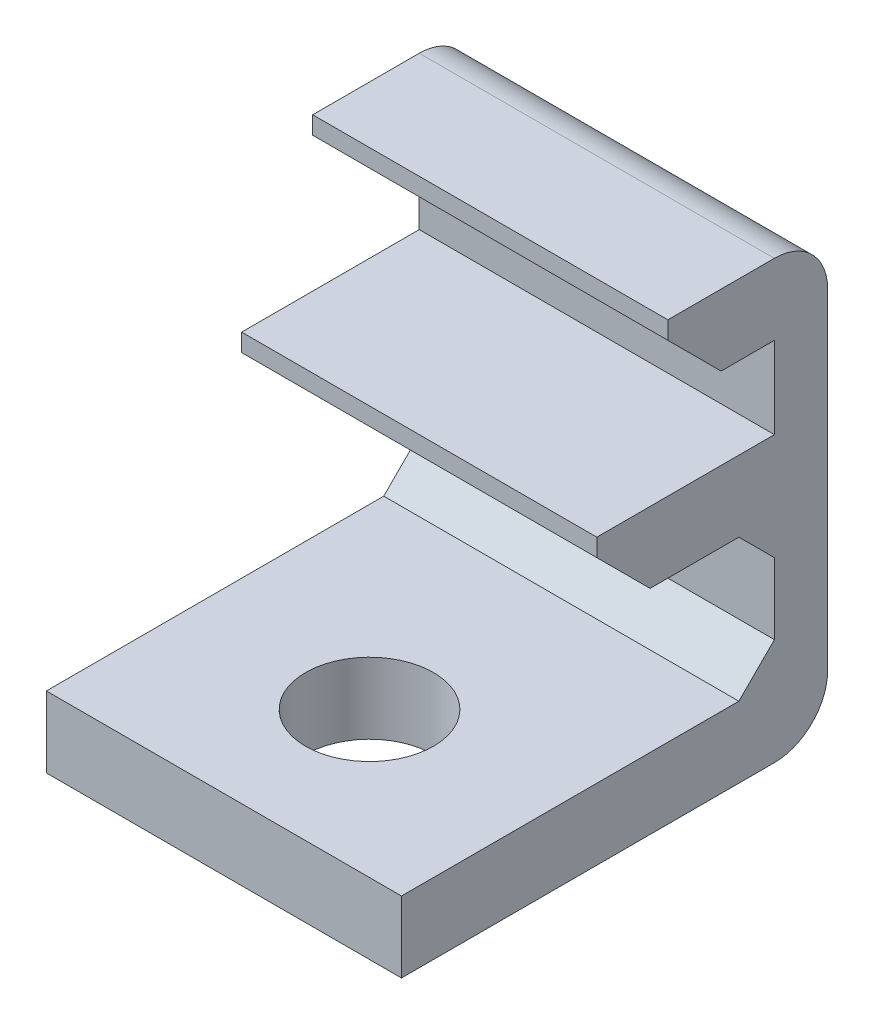
ISO-10303-21;
HEADER;
FILE_DESCRIPTION(('STEP AP214'),'2;1');
FILE_NAME('part.step','',(''),(''),'','','');
FILE_SCHEMA(('AUTOMOTIVE_DESIGN { 1 0 10303 214 1 1 1 1 }'));
ENDSEC;
DATA;
#1=APPLICATION_CONTEXT('core data for automotive mechanical design processes');
#2=APPLICATION_PROTOCOL_DEFINITION('international standard','automotive_design',2000,#1);
#3=PRODUCT_CONTEXT('',#1,'mechanical');
#4=PRODUCT('Part','Part','',(#3));
#5=PRODUCT_RELATED_PRODUCT_CATEGORY('part','',(#4));
#6=PRODUCT_DEFINITION_FORMATION('','',#4);
#7=PRODUCT_DEFINITION_CONTEXT('part definition',#1,'design');
#8=PRODUCT_DEFINITION('design','',#6,#7);
#9=PRODUCT_DEFINITION_SHAPE('','',#8);
#10=(LENGTH_UNIT() NAMED_UNIT(*) SI_UNIT(.MILLI.,.METRE.));
#11=(NAMED_UNIT(*) PLANE_ANGLE_UNIT() SI_UNIT($,.RADIAN.));
#12=(NAMED_UNIT(*) SI_UNIT($,.STERADIAN.) SOLID_ANGLE_UNIT());
#13=UNCERTAINTY_MEASURE_WITH_UNIT(LENGTH_MEASURE(1.E-05),#10,'distance_accuracy_value','');
#14=(GEOMETRIC_REPRESENTATION_CONTEXT(3) GLOBAL_UNCERTAINTY_ASSIGNED_CONTEXT((#13)) GLOBAL_UNIT_ASSIGNED_CONTEXT((#10,
#11,#12)) REPRESENTATION_CONTEXT('',''));
#15=CARTESIAN_POINT('',(0.,0.,0.));
#16=DIRECTION('',(0.,0.,1.));
#17=DIRECTION('',(1.,0.,0.));
#18=AXIS2_PLACEMENT_3D('',#15,#16,#17);
#19=CARTESIAN_POINT('',(5.,0.,-0.249999999999999));
#20=DIRECTION('',(0.,0.,-1.));
#21=DIRECTION('',(0.,1.,0.));
#22=AXIS2_PLACEMENT_3D('',#19,#20,#21);
#23=PLANE('',#22);
#24=DIRECTION('',(0.,-1.,0.));
#25=VECTOR('',#24,1.);
#26=CARTESIAN_POINT('',(-5.,0.,-0.249999999999999));
#27=LINE('',#26,#25);
#28=CARTESIAN_POINT('',(-5.,1.85,-0.249999999999999));
#29=VERTEX_POINT('',#28);
#30=CARTESIAN_POINT('',(-5.,1.35,-0.249999999999999));
#31=VERTEX_POINT('',#30);
#32=EDGE_CURVE('E217',#29,#31,#27,.T.);
#33=ORIENTED_EDGE('',*,*,#32,.T.);
#34=DIRECTION('',(1.,0.,0.));
#35=VECTOR('',#34,1.);
#36=CARTESIAN_POINT('',(5.,1.35,-0.249999999999999));
#37=LINE('',#36,#35);
#38=CARTESIAN_POINT('',(5.,1.35,-0.249999999999999));
#39=VERTEX_POINT('',#38);
#40=EDGE_CURVE('E11',#31,#39,#37,.T.);
#41=ORIENTED_EDGE('',*,*,#40,.T.);
#42=DIRECTION('',(0.,-1.,0.));
#43=VECTOR('',#42,1.);
#44=CARTESIAN_POINT('',(5.,0.,-0.249999999999999));
#45=LINE('',#44,#43);
#46=CARTESIAN_POINT('',(5.,1.85,-0.249999999999999));
#47=VERTEX_POINT('',#46);
#48=EDGE_CURVE('E248',#47,#39,#45,.T.);
#49=ORIENTED_EDGE('',*,*,#48,.F.);
#50=DIRECTION('',(-1.,0.,0.));
#51=VECTOR('',#50,1.);
#52=CARTESIAN_POINT('',(5.,1.85,-0.249999999999999));
#53=LINE('',#52,#51);
#54=EDGE_CURVE('E216',#47,#29,#53,.T.);
#55=ORIENTED_EDGE('',*,*,#54,.T.);
#56=EDGE_LOOP('',(#33,#41,#49,#55));
#57=FACE_BOUND('',#56,.T.);
#58=ADVANCED_FACE('F41',(#57),#23,.F.);
#59=CARTESIAN_POINT('',(5.,-0.149999999999999,0.));
#60=DIRECTION('',(0.,1.,0.));
#61=DIRECTION('',(0.,0.,1.));
#62=AXIS2_PLACEMENT_3D('',#59,#60,#61);
#63=PLANE('',#62);
#64=DIRECTION('',(0.,0.,-1.));
#65=VECTOR('',#64,1.);
#66=CARTESIAN_POINT('',(5.,-0.149999999999999,0.));
#67=LINE('',#66,#65);
#68=CARTESIAN_POINT('',(5.,-0.15,-1.75));
#69=VERTEX_POINT('',#68);
#70=CARTESIAN_POINT('',(5.,-0.150000000000001,-4.25000000000001));
#71=VERTEX_POINT('',#70);
#72=EDGE_CURVE('E196',#69,#71,#67,.T.);
#73=ORIENTED_EDGE('',*,*,#72,.F.);
#74=DIRECTION('',(-1.,0.,0.));
#75=VECTOR('',#74,1.);
#76=CARTESIAN_POINT('',(5.,-0.15,-1.75));
#77=LINE('',#76,#75);
#78=CARTESIAN_POINT('',(-5.,-0.15,-1.75));
#79=VERTEX_POINT('',#78);
#80=EDGE_CURVE('E50',#69,#79,#77,.T.);
#81=ORIENTED_EDGE('',*,*,#80,.T.);
#82=DIRECTION('',(0.,0.,-1.));
#83=VECTOR('',#82,1.);
#84=CARTESIAN_POINT('',(-5.,-0.149999999999999,0.));
#85=LINE('',#84,#83);
#86=CARTESIAN_POINT('',(-5.,-0.150000000000001,-4.25000000000001));
#87=VERTEX_POINT('',#86);
#88=EDGE_CURVE('E219',#79,#87,#85,.T.);
#89=ORIENTED_EDGE('',*,*,#88,.T.);
#90=DIRECTION('',(1.,0.,0.));
#91=VECTOR('',#90,1.);
#92=CARTESIAN_POINT('',(5.,-0.150000000000001,-4.25000000000001));
#93=LINE('',#92,#91);
#94=EDGE_CURVE('E264',#87,#71,#93,.T.);
#95=ORIENTED_EDGE('',*,*,#94,.T.);
#96=EDGE_LOOP('',(#73,#81,#89,#95));
#97=FACE_BOUND('',#96,.T.);
#98=ADVANCED_FACE('F308',(#97),#63,.F.);
#99=CARTESIAN_POINT('',(5.,0.,-5.25));
#100=DIRECTION('',(0.,0.,-1.));
#101=DIRECTION('',(0.,1.,0.));
#102=AXIS2_PLACEMENT_3D('',#99,#100,#101);
#103=PLANE('',#102);
#104=DIRECTION('',(0.,-1.,0.));
#105=VECTOR('',#104,1.);
#106=CARTESIAN_POINT('',(-5.,0.,-5.25));
#107=LINE('',#106,#105);
#108=CARTESIAN_POINT('',(-5.,-1.15000000000001,-5.25));
#109=VERTEX_POINT('',#108);
#110=CARTESIAN_POINT('',(-5.,-3.15000000000001,-5.25));
#111=VERTEX_POINT('',#110);
#112=EDGE_CURVE('E222',#109,#111,#107,.T.);
#113=ORIENTED_EDGE('',*,*,#112,.T.);
#114=DIRECTION('',(1.,0.,0.));
#115=VECTOR('',#114,1.);
#116=CARTESIAN_POINT('',(5.,-3.15000000000001,-5.25));
#117=LINE('',#116,#115);
#118=CARTESIAN_POINT('',(5.,-3.15000000000001,-5.25));
#119=VERTEX_POINT('',#118);
#120=EDGE_CURVE('E262',#111,#119,#117,.T.);
#121=ORIENTED_EDGE('',*,*,#120,.T.);
#122=DIRECTION('',(0.,-1.,0.));
#123=VECTOR('',#122,1.);
#124=CARTESIAN_POINT('',(5.,0.,-5.25));
#125=LINE('',#124,#123);
#126=CARTESIAN_POINT('',(5.,-1.15000000000001,-5.25));
#127=VERTEX_POINT('',#126);
#128=EDGE_CURVE('E194',#127,#119,#125,.T.);
#129=ORIENTED_EDGE('',*,*,#128,.F.);
#130=DIRECTION('',(-1.,0.,0.));
#131=VECTOR('',#130,1.);
#132=CARTESIAN_POINT('',(-5.,-1.15000000000001,-5.25));
#133=LINE('',#132,#131);
#134=EDGE_CURVE('E259',#127,#109,#133,.T.);
#135=ORIENTED_EDGE('',*,*,#134,.T.);
#136=EDGE_LOOP('',(#113,#121,#129,#135));
#137=FACE_BOUND('',#136,.T.);
#138=ADVANCED_FACE('F322',(#137),#103,.F.);
#139=CARTESIAN_POINT('',(5.,-4.15,0.));
#140=DIRECTION('',(0.,1.,0.));
#141=DIRECTION('',(0.,0.,1.));
#142=AXIS2_PLACEMENT_3D('',#139,#140,#141);
#143=PLANE('',#142);
#144=CARTESIAN_POINT('',(0.,-4.15,1.15));
#145=DIRECTION('',(0.,1.,0.));
#146=DIRECTION('',(0.,0.,1.));
#147=AXIS2_PLACEMENT_3D('',#144,#145,#146);
#148=CIRCLE('',#147,1.8);
#149=CARTESIAN_POINT('',(0.,-4.15,2.95));
#150=VERTEX_POINT('',#149);
#151=EDGE_CURVE('E220',#150,#150,#148,.F.);
#152=ORIENTED_EDGE('',*,*,#151,.T.);
#153=EDGE_LOOP('',(#152));
#154=FACE_BOUND('',#153,.T.);
#155=DIRECTION('',(0.,0.,-1.));
#156=VECTOR('',#155,1.);
#157=CARTESIAN_POINT('',(5.,-4.15,0.));
#158=LINE('',#157,#156);
#159=CARTESIAN_POINT('',(5.,-4.15,5.25));
#160=VERTEX_POINT('',#159);
#161=CARTESIAN_POINT('',(5.,-4.15,-4.25));
#162=VERTEX_POINT('',#161);
#163=EDGE_CURVE('E172',#160,#162,#158,.T.);
#164=ORIENTED_EDGE('',*,*,#163,.T.);
#165=DIRECTION('',(-1.,0.,0.));
#166=VECTOR('',#165,1.);
#167=CARTESIAN_POINT('',(5.,-4.15,-4.25));
#168=LINE('',#167,#166);
#169=CARTESIAN_POINT('',(-5.,-4.15,-4.25));
#170=VERTEX_POINT('',#169);
#171=EDGE_CURVE('E178',#162,#170,#168,.T.);
#172=ORIENTED_EDGE('',*,*,#171,.T.);
#173=DIRECTION('',(0.,0.,-1.));
#174=VECTOR('',#173,1.);
#175=CARTESIAN_POINT('',(-5.,-4.15,0.));
#176=LINE('',#175,#174);
#177=CARTESIAN_POINT('',(-5.,-4.15,5.25));
#178=VERTEX_POINT('',#177);
#179=EDGE_CURVE('E175',#178,#170,#176,.T.);
#180=ORIENTED_EDGE('',*,*,#179,.F.);
#181=DIRECTION('',(-1.,0.,0.));
#182=VECTOR('',#181,1.);
#183=CARTESIAN_POINT('',(5.,-4.15,5.25));
#184=LINE('',#183,#182);
#185=EDGE_CURVE('E167',#160,#178,#184,.T.);
#186=ORIENTED_EDGE('',*,*,#185,.F.);
#187=EDGE_LOOP('',(#164,#172,#180,#186));
#188=FACE_BOUND('',#187,.T.);
#189=ADVANCED_FACE('F169',(#154,#188),#143,.T.);
#190=CARTESIAN_POINT('',(5.,0.,5.25));
#191=DIRECTION('',(0.,0.,-1.));
#192=DIRECTION('',(0.,1.,0.));
#193=AXIS2_PLACEMENT_3D('',#190,#191,#192);
#194=PLANE('',#193);
#195=DIRECTION('',(0.,-1.,0.));
#196=VECTOR('',#195,1.);
#197=CARTESIAN_POINT('',(-5.,0.,5.25));
#198=LINE('',#197,#196);
#199=CARTESIAN_POINT('',(-5.,-6.15,5.25));
#200=VERTEX_POINT('',#199);
#201=EDGE_CURVE('E226',#178,#200,#198,.T.);
#202=ORIENTED_EDGE('',*,*,#201,.T.);
#203=DIRECTION('',(-1.,0.,0.));
#204=VECTOR('',#203,1.);
#205=CARTESIAN_POINT('',(5.,-6.15,5.25));
#206=LINE('',#205,#204);
#207=CARTESIAN_POINT('',(5.,-6.15,5.25));
#208=VERTEX_POINT('',#207);
#209=EDGE_CURVE('E179',#208,#200,#206,.T.);
#210=ORIENTED_EDGE('',*,*,#209,.F.);
#211=DIRECTION('',(0.,-1.,0.));
#212=VECTOR('',#211,1.);
#213=CARTESIAN_POINT('',(5.,0.,5.25));
#214=LINE('',#213,#212);
#215=EDGE_CURVE('E182',#160,#208,#214,.T.);
#216=ORIENTED_EDGE('',*,*,#215,.F.);
#217=ORIENTED_EDGE('',*,*,#185,.T.);
#218=EDGE_LOOP('',(#202,#210,#216,#217));
#219=FACE_BOUND('',#218,.T.);
#220=ADVANCED_FACE('F183',(#219),#194,.F.);
#221=CARTESIAN_POINT('',(5.,-6.15,0.));
#222=DIRECTION('',(0.,1.,0.));
#223=DIRECTION('',(0.,0.,1.));
#224=AXIS2_PLACEMENT_3D('',#221,#222,#223);
#225=PLANE('',#224);
#226=CARTESIAN_POINT('',(0.,-6.15,1.15));
#227=DIRECTION('',(0.,1.,0.));
#228=DIRECTION('',(0.,0.,1.));
#229=AXIS2_PLACEMENT_3D('',#226,#227,#228);
#230=CIRCLE('',#229,1.8);
#231=CARTESIAN_POINT('',(0.,-6.15,2.95));
#232=VERTEX_POINT('',#231);
#233=EDGE_CURVE('E372',#232,#232,#230,.T.);
#234=ORIENTED_EDGE('',*,*,#233,.T.);
#235=EDGE_LOOP('',(#234));
#236=FACE_BOUND('',#235,.T.);
#237=DIRECTION('',(0.,0.,-1.));
#238=VECTOR('',#237,1.);
#239=CARTESIAN_POINT('',(-5.,-6.15,0.));
#240=LINE('',#239,#238);
#241=CARTESIAN_POINT('',(-5.,-6.15,-5.25));
#242=VERTEX_POINT('',#241);
#243=EDGE_CURVE('E228',#200,#242,#240,.T.);
#244=ORIENTED_EDGE('',*,*,#243,.T.);
#245=DIRECTION('',(-1.,0.,0.));
#246=VECTOR('',#245,1.);
#247=CARTESIAN_POINT('',(5.,-6.15,-5.25));
#248=LINE('',#247,#246);
#249=CARTESIAN_POINT('',(5.,-6.15,-5.25));
#250=VERTEX_POINT('',#249);
#251=EDGE_CURVE('E284',#242,#250,#248,.F.);
#252=ORIENTED_EDGE('',*,*,#251,.T.);
#253=DIRECTION('',(0.,0.,-1.));
#254=VECTOR('',#253,1.);
#255=CARTESIAN_POINT('',(5.,-6.15,0.));
#256=LINE('',#255,#254);
#257=EDGE_CURVE('E187',#208,#250,#256,.T.);
#258=ORIENTED_EDGE('',*,*,#257,.F.);
#259=ORIENTED_EDGE('',*,*,#209,.T.);
#260=EDGE_LOOP('',(#244,#252,#258,#259));
#261=FACE_BOUND('',#260,.T.);
#262=ADVANCED_FACE('F328',(#236,#261),#225,.F.);
#263=CARTESIAN_POINT('',(5.,0.,-6.75));
#264=DIRECTION('',(0.,0.,-1.));
#265=DIRECTION('',(0.,1.,0.));
#266=AXIS2_PLACEMENT_3D('',#263,#264,#265);
#267=PLANE('',#266);
#268=DIRECTION('',(0.,-1.,0.));
#269=VECTOR('',#268,1.);
#270=CARTESIAN_POINT('',(5.,0.,-6.75));
#271=LINE('',#270,#269);
#272=CARTESIAN_POINT('',(5.,4.65,-6.75));
#273=VERTEX_POINT('',#272);
#274=CARTESIAN_POINT('',(5.,-4.65,-6.75));
#275=VERTEX_POINT('',#274);
#276=EDGE_CURVE('E201',#273,#275,#271,.T.);
#277=ORIENTED_EDGE('',*,*,#276,.T.);
#278=DIRECTION('',(-1.,0.,0.));
#279=VECTOR('',#278,1.);
#280=CARTESIAN_POINT('',(-5.,-4.65,-6.75));
#281=LINE('',#280,#279);
#282=CARTESIAN_POINT('',(-5.,-4.65,-6.75));
#283=VERTEX_POINT('',#282);
#284=EDGE_CURVE('E277',#275,#283,#281,.T.);
#285=ORIENTED_EDGE('',*,*,#284,.T.);
#286=DIRECTION('',(0.,-1.,0.));
#287=VECTOR('',#286,1.);
#288=CARTESIAN_POINT('',(-5.,0.,-6.75));
#289=LINE('',#288,#287);
#290=CARTESIAN_POINT('',(-5.,4.65,-6.75));
#291=VERTEX_POINT('',#290);
#292=EDGE_CURVE('E231',#291,#283,#289,.T.);
#293=ORIENTED_EDGE('',*,*,#292,.F.);
#294=DIRECTION('',(-1.,0.,0.));
#295=VECTOR('',#294,1.);
#296=CARTESIAN_POINT('',(5.,4.65,-6.75));
#297=LINE('',#296,#295);
#298=EDGE_CURVE('E275',#291,#273,#297,.F.);
#299=ORIENTED_EDGE('',*,*,#298,.T.);
#300=EDGE_LOOP('',(#277,#285,#293,#299));
#301=FACE_BOUND('',#300,.T.);
#302=ADVANCED_FACE('F337',(#301),#267,.T.);
#303=CARTESIAN_POINT('',(5.,6.15,0.));
#304=DIRECTION('',(0.,1.,0.));
#305=DIRECTION('',(0.,0.,1.));
#306=AXIS2_PLACEMENT_3D('',#303,#304,#305);
#307=PLANE('',#306);
#308=DIRECTION('',(0.,0.,-1.));
#309=VECTOR('',#308,1.);
#310=CARTESIAN_POINT('',(5.,6.15,0.));
#311=LINE('',#310,#309);
#312=CARTESIAN_POINT('',(5.,6.15,-2.25000000000001));
#313=VERTEX_POINT('',#312);
#314=CARTESIAN_POINT('',(5.,6.15,-5.25));
#315=VERTEX_POINT('',#314);
#316=EDGE_CURVE('E204',#313,#315,#311,.T.);
#317=ORIENTED_EDGE('',*,*,#316,.T.);
#318=DIRECTION('',(-1.,0.,0.));
#319=VECTOR('',#318,1.);
#320=CARTESIAN_POINT('',(5.,6.15,-5.25));
#321=LINE('',#320,#319);
#322=CARTESIAN_POINT('',(-5.,6.15,-5.25));
#323=VERTEX_POINT('',#322);
#324=EDGE_CURVE('E290',#315,#323,#321,.T.);
#325=ORIENTED_EDGE('',*,*,#324,.T.);
#326=DIRECTION('',(0.,0.,-1.));
#327=VECTOR('',#326,1.);
#328=CARTESIAN_POINT('',(-5.,6.15,0.));
#329=LINE('',#328,#327);
#330=CARTESIAN_POINT('',(-5.,6.15,-2.25000000000001));
#331=VERTEX_POINT('',#330);
#332=EDGE_CURVE('E234',#331,#323,#329,.T.);
#333=ORIENTED_EDGE('',*,*,#332,.F.);
#334=DIRECTION('',(-1.,0.,0.));
#335=VECTOR('',#334,1.);
#336=CARTESIAN_POINT('',(5.,6.15,-2.25000000000001));
#337=LINE('',#336,#335);
#338=EDGE_CURVE('E255',#313,#331,#337,.T.);
#339=ORIENTED_EDGE('',*,*,#338,.F.);
#340=EDGE_LOOP('',(#317,#325,#333,#339));
#341=FACE_BOUND('',#340,.T.);
#342=ADVANCED_FACE('F346',(#341),#307,.T.);
#343=CARTESIAN_POINT('',(5.,0.,-2.25000000000001));
#344=DIRECTION('',(0.,0.,-1.));
#345=DIRECTION('',(0.,1.,0.));
#346=AXIS2_PLACEMENT_3D('',#343,#344,#345);
#347=PLANE('',#346);
#348=DIRECTION('',(0.,-1.,0.));
#349=VECTOR('',#348,1.);
#350=CARTESIAN_POINT('',(-5.,0.,-2.25000000000001));
#351=LINE('',#350,#349);
#352=CARTESIAN_POINT('',(-5.,5.65000000000001,-2.25000000000001));
#353=VERTEX_POINT('',#352);
#354=EDGE_CURVE('E237',#331,#353,#351,.T.);
#355=ORIENTED_EDGE('',*,*,#354,.T.);
#356=DIRECTION('',(1.,0.,0.));
#357=VECTOR('',#356,1.);
#358=CARTESIAN_POINT('',(5.,5.65000000000001,-2.25000000000001));
#359=LINE('',#358,#357);
#360=CARTESIAN_POINT('',(5.,5.65000000000001,-2.25000000000001));
#361=VERTEX_POINT('',#360);
#362=EDGE_CURVE('E300',#353,#361,#359,.T.);
#363=ORIENTED_EDGE('',*,*,#362,.T.);
#364=DIRECTION('',(0.,-1.,0.));
#365=VECTOR('',#364,1.);
#366=CARTESIAN_POINT('',(5.,0.,-2.25000000000001));
#367=LINE('',#366,#365);
#368=EDGE_CURVE('E207',#313,#361,#367,.T.);
#369=ORIENTED_EDGE('',*,*,#368,.F.);
#370=ORIENTED_EDGE('',*,*,#338,.T.);
#371=EDGE_LOOP('',(#355,#363,#369,#370));
#372=FACE_BOUND('',#371,.T.);
#373=ADVANCED_FACE('F447',(#372),#347,.F.);
#374=CARTESIAN_POINT('',(5.,4.15,0.));
#375=DIRECTION('',(0.,1.,0.));
#376=DIRECTION('',(0.,0.,1.));
#377=AXIS2_PLACEMENT_3D('',#374,#375,#376);
#378=PLANE('',#377);
#379=DIRECTION('',(0.,0.,-1.));
#380=VECTOR('',#379,1.);
#381=CARTESIAN_POINT('',(5.,4.15,0.));
#382=LINE('',#381,#380);
#383=CARTESIAN_POINT('',(5.,4.15,-3.75000000000001));
#384=VERTEX_POINT('',#383);
#385=CARTESIAN_POINT('',(5.,4.15,-5.25));
#386=VERTEX_POINT('',#385);
#387=EDGE_CURVE('E209',#384,#386,#382,.T.);
#388=ORIENTED_EDGE('',*,*,#387,.F.);
#389=DIRECTION('',(-1.,0.,0.));
#390=VECTOR('',#389,1.);
#391=CARTESIAN_POINT('',(5.,4.15,-3.75000000000001));
#392=LINE('',#391,#390);
#393=CARTESIAN_POINT('',(-5.,4.15,-3.75000000000001));
#394=VERTEX_POINT('',#393);
#395=EDGE_CURVE('E293',#384,#394,#392,.T.);
#396=ORIENTED_EDGE('',*,*,#395,.T.);
#397=DIRECTION('',(0.,0.,-1.));
#398=VECTOR('',#397,1.);
#399=CARTESIAN_POINT('',(-5.,4.15,0.));
#400=LINE('',#399,#398);
#401=CARTESIAN_POINT('',(-5.,4.15,-5.25));
#402=VERTEX_POINT('',#401);
#403=EDGE_CURVE('E240',#394,#402,#400,.T.);
#404=ORIENTED_EDGE('',*,*,#403,.T.);
#405=DIRECTION('',(-1.,0.,0.));
#406=VECTOR('',#405,1.);
#407=CARTESIAN_POINT('',(5.,4.15,-5.25));
#408=LINE('',#407,#406);
#409=EDGE_CURVE('E252',#386,#402,#408,.T.);
#410=ORIENTED_EDGE('',*,*,#409,.F.);
#411=EDGE_LOOP('',(#388,#396,#404,#410));
#412=FACE_BOUND('',#411,.T.);
#413=ADVANCED_FACE('F357',(#412),#378,.F.);
#414=CARTESIAN_POINT('',(5.,0.,-5.25));
#415=DIRECTION('',(0.,0.,-1.));
#416=DIRECTION('',(-1.,0.,0.));
#417=AXIS2_PLACEMENT_3D('',#414,#415,#416);
#418=PLANE('',#417);
#419=DIRECTION('',(0.,-1.,0.));
#420=VECTOR('',#419,1.);
#421=CARTESIAN_POINT('',(-5.,0.,-5.25));
#422=LINE('',#421,#420);
#423=CARTESIAN_POINT('',(-5.,1.85,-5.25));
#424=VERTEX_POINT('',#423);
#425=EDGE_CURVE('E242',#402,#424,#422,.T.);
#426=ORIENTED_EDGE('',*,*,#425,.T.);
#427=DIRECTION('',(-1.,0.,0.));
#428=VECTOR('',#427,1.);
#429=CARTESIAN_POINT('',(5.,1.85,-5.25));
#430=LINE('',#429,#428);
#431=CARTESIAN_POINT('',(5.,1.85,-5.25));
#432=VERTEX_POINT('',#431);
#433=EDGE_CURVE('E250',#432,#424,#430,.T.);
#434=ORIENTED_EDGE('',*,*,#433,.F.);
#435=DIRECTION('',(0.,-1.,0.));
#436=VECTOR('',#435,1.);
#437=CARTESIAN_POINT('',(5.,0.,-5.25));
#438=LINE('',#437,#436);
#439=EDGE_CURVE('E211',#386,#432,#438,.T.);
#440=ORIENTED_EDGE('',*,*,#439,.F.);
#441=ORIENTED_EDGE('',*,*,#409,.T.);
#442=EDGE_LOOP('',(#426,#434,#440,#441));
#443=FACE_BOUND('',#442,.T.);
#444=ADVANCED_FACE('F363',(#443),#418,.F.);
#445=CARTESIAN_POINT('',(5.,1.85,0.));
#446=DIRECTION('',(0.,1.,0.));
#447=DIRECTION('',(0.,0.,1.));
#448=AXIS2_PLACEMENT_3D('',#445,#446,#447);
#449=PLANE('',#448);
#450=DIRECTION('',(0.,0.,-1.));
#451=VECTOR('',#450,1.);
#452=CARTESIAN_POINT('',(-5.,1.85,0.));
#453=LINE('',#452,#451);
#454=EDGE_CURVE('E245',#29,#424,#453,.T.);
#455=ORIENTED_EDGE('',*,*,#454,.F.);
#456=ORIENTED_EDGE('',*,*,#54,.F.);
#457=DIRECTION('',(0.,0.,-1.));
#458=VECTOR('',#457,1.);
#459=CARTESIAN_POINT('',(5.,1.85,0.));
#460=LINE('',#459,#458);
#461=EDGE_CURVE('E213',#47,#432,#460,.T.);
#462=ORIENTED_EDGE('',*,*,#461,.T.);
#463=ORIENTED_EDGE('',*,*,#433,.T.);
#464=EDGE_LOOP('',(#455,#456,#462,#463));
#465=FACE_BOUND('',#464,.T.);
#466=ADVANCED_FACE('F367',(#465),#449,.T.);
#467=CARTESIAN_POINT('',(5.,0.,0.));
#468=DIRECTION('',(1.,0.,0.));
#469=DIRECTION('',(0.,0.,-1.));
#470=AXIS2_PLACEMENT_3D('',#467,#468,#469);
#471=PLANE('',#470);
#472=ORIENTED_EDGE('',*,*,#368,.T.);
#473=DIRECTION('',(0.,0.707106781186549,0.707106781186546));
#474=VECTOR('',#473,1.);
#475=CARTESIAN_POINT('',(5.,3.95,-3.95000000000001));
#476=LINE('',#475,#474);
#477=EDGE_CURVE('E303',#361,#384,#476,.F.);
#478=ORIENTED_EDGE('',*,*,#477,.T.);
#479=ORIENTED_EDGE('',*,*,#387,.T.);
#480=ORIENTED_EDGE('',*,*,#439,.T.);
#481=ORIENTED_EDGE('',*,*,#461,.F.);
#482=ORIENTED_EDGE('',*,*,#48,.T.);
#483=DIRECTION('',(0.,0.707106781186549,0.707106781186546));
#484=VECTOR('',#483,1.);
#485=CARTESIAN_POINT('',(5.,0.8,-0.800000000000002));
#486=LINE('',#485,#484);
#487=EDGE_CURVE('E57',#39,#69,#486,.F.);
#488=ORIENTED_EDGE('',*,*,#487,.T.);
#489=ORIENTED_EDGE('',*,*,#72,.T.);
#490=DIRECTION('',(0.,0.707106781186551,0.707106781186544));
#491=VECTOR('',#490,1.);
#492=CARTESIAN_POINT('',(5.,-1.15000000000001,-5.25));
#493=LINE('',#492,#491);
#494=EDGE_CURVE('E273',#71,#127,#493,.F.);
#495=ORIENTED_EDGE('',*,*,#494,.T.);
#496=ORIENTED_EDGE('',*,*,#128,.T.);
#497=DIRECTION('',(0.,-0.707106781186544,0.707106781186551));
#498=VECTOR('',#497,1.);
#499=CARTESIAN_POINT('',(5.,-4.15,-4.25));
#500=LINE('',#499,#498);
#501=EDGE_CURVE('E193',#119,#162,#500,.T.);
#502=ORIENTED_EDGE('',*,*,#501,.T.);
#503=ORIENTED_EDGE('',*,*,#163,.F.);
#504=ORIENTED_EDGE('',*,*,#215,.T.);
#505=ORIENTED_EDGE('',*,*,#257,.T.);
#506=CARTESIAN_POINT('',(5.,-4.65,-5.25));
#507=DIRECTION('',(1.,0.,0.));
#508=DIRECTION('',(0.,0.,-1.));
#509=AXIS2_PLACEMENT_3D('',#506,#507,#508);
#510=CIRCLE('',#509,1.5);
#511=EDGE_CURVE('E288',#250,#275,#510,.T.);
#512=ORIENTED_EDGE('',*,*,#511,.T.);
#513=ORIENTED_EDGE('',*,*,#276,.F.);
#514=CARTESIAN_POINT('',(5.,4.65,-5.25));
#515=DIRECTION('',(1.,0.,0.));
#516=DIRECTION('',(0.,0.,-1.));
#517=AXIS2_PLACEMENT_3D('',#514,#515,#516);
#518=CIRCLE('',#517,1.5);
#519=EDGE_CURVE('E286',#273,#315,#518,.T.);
#520=ORIENTED_EDGE('',*,*,#519,.T.);
#521=ORIENTED_EDGE('',*,*,#316,.F.);
#522=EDGE_LOOP('',(#472,#478,#479,#480,#481,#482,#488,#489,#495,#496,#502,#503,#504,#505,#512,
#513,#520,#521));
#523=FACE_BOUND('',#522,.T.);
#524=ADVANCED_FACE('F190',(#523),#471,.T.);
#525=CARTESIAN_POINT('',(-5.,0.,0.));
#526=DIRECTION('',(1.,0.,0.));
#527=DIRECTION('',(0.,0.,-1.));
#528=AXIS2_PLACEMENT_3D('',#525,#526,#527);
#529=PLANE('',#528);
#530=ORIENTED_EDGE('',*,*,#403,.F.);
#531=DIRECTION('',(0.,-0.707106781186549,-0.707106781186546));
#532=VECTOR('',#531,1.);
#533=CARTESIAN_POINT('',(-5.,4.15,-3.75000000000001));
#534=LINE('',#533,#532);
#535=EDGE_CURVE('E298',#394,#353,#534,.F.);
#536=ORIENTED_EDGE('',*,*,#535,.T.);
#537=ORIENTED_EDGE('',*,*,#354,.F.);
#538=ORIENTED_EDGE('',*,*,#332,.T.);
#539=CARTESIAN_POINT('',(-5.,4.65,-5.25));
#540=DIRECTION('',(1.,0.,0.));
#541=DIRECTION('',(0.,0.,-1.));
#542=AXIS2_PLACEMENT_3D('',#539,#540,#541);
#543=CIRCLE('',#542,1.5);
#544=EDGE_CURVE('E280',#323,#291,#543,.F.);
#545=ORIENTED_EDGE('',*,*,#544,.T.);
#546=ORIENTED_EDGE('',*,*,#292,.T.);
#547=CARTESIAN_POINT('',(-5.,-4.65,-5.25));
#548=DIRECTION('',(1.,0.,0.));
#549=DIRECTION('',(0.,0.,-1.));
#550=AXIS2_PLACEMENT_3D('',#547,#548,#549);
#551=CIRCLE('',#550,1.5);
#552=EDGE_CURVE('E282',#283,#242,#551,.F.);
#553=ORIENTED_EDGE('',*,*,#552,.T.);
#554=ORIENTED_EDGE('',*,*,#243,.F.);
#555=ORIENTED_EDGE('',*,*,#201,.F.);
#556=ORIENTED_EDGE('',*,*,#179,.T.);
#557=DIRECTION('',(0.,0.707106781186544,-0.707106781186551));
#558=VECTOR('',#557,1.);
#559=CARTESIAN_POINT('',(-5.,-4.20000000000002,-4.19999999999998));
#560=LINE('',#559,#558);
#561=EDGE_CURVE('E267',#170,#111,#560,.T.);
#562=ORIENTED_EDGE('',*,*,#561,.T.);
#563=ORIENTED_EDGE('',*,*,#112,.F.);
#564=DIRECTION('',(0.,-0.707106781186551,-0.707106781186544));
#565=VECTOR('',#564,1.);
#566=CARTESIAN_POINT('',(-5.,2.05,-2.05000000000003));
#567=LINE('',#566,#565);
#568=EDGE_CURVE('E270',#109,#87,#567,.F.);
#569=ORIENTED_EDGE('',*,*,#568,.T.);
#570=ORIENTED_EDGE('',*,*,#88,.F.);
#571=DIRECTION('',(0.,-0.707106781186549,-0.707106781186546));
#572=VECTOR('',#571,1.);
#573=CARTESIAN_POINT('',(-5.,-0.15,-1.75));
#574=LINE('',#573,#572);
#575=EDGE_CURVE('E296',#79,#31,#574,.F.);
#576=ORIENTED_EDGE('',*,*,#575,.T.);
#577=ORIENTED_EDGE('',*,*,#32,.F.);
#578=ORIENTED_EDGE('',*,*,#454,.T.);
#579=ORIENTED_EDGE('',*,*,#425,.F.);
#580=EDGE_LOOP('',(#530,#536,#537,#538,#545,#546,#553,#554,#555,#556,#562,#563,#569,#570,#576,
#577,#578,#579));
#581=FACE_BOUND('',#580,.T.);
#582=ADVANCED_FACE('F312',(#581),#529,.F.);
#583=CARTESIAN_POINT('',(5.,-4.15,-4.25));
#584=DIRECTION('',(0.,-0.707106781186551,-0.707106781186544));
#585=DIRECTION('',(-1.,0.,0.));
#586=AXIS2_PLACEMENT_3D('',#583,#584,#585);
#587=PLANE('',#586);
#588=ORIENTED_EDGE('',*,*,#501,.F.);
#589=ORIENTED_EDGE('',*,*,#120,.F.);
#590=ORIENTED_EDGE('',*,*,#561,.F.);
#591=ORIENTED_EDGE('',*,*,#171,.F.);
#592=EDGE_LOOP('',(#588,#589,#590,#591));
#593=FACE_BOUND('',#592,.T.);
#594=ADVANCED_FACE('F325',(#593),#587,.F.);
#595=CARTESIAN_POINT('',(5.,-1.15000000000001,-5.25));
#596=DIRECTION('',(0.,-0.707106781186544,0.707106781186551));
#597=DIRECTION('',(1.,0.,0.));
#598=AXIS2_PLACEMENT_3D('',#595,#596,#597);
#599=PLANE('',#598);
#600=ORIENTED_EDGE('',*,*,#494,.F.);
#601=ORIENTED_EDGE('',*,*,#94,.F.);
#602=ORIENTED_EDGE('',*,*,#568,.F.);
#603=ORIENTED_EDGE('',*,*,#134,.F.);
#604=EDGE_LOOP('',(#600,#601,#602,#603));
#605=FACE_BOUND('',#604,.T.);
#606=ADVANCED_FACE('F319',(#605),#599,.T.);
#607=CARTESIAN_POINT('',(0.,-1.15,1.15));
#608=DIRECTION('',(0.,-1.,0.));
#609=DIRECTION('',(0.,0.,-1.));
#610=AXIS2_PLACEMENT_3D('',#607,#608,#609);
#611=CYLINDRICAL_SURFACE('',#610,1.8);
#612=ORIENTED_EDGE('',*,*,#151,.F.);
#613=EDGE_LOOP('',(#612));
#614=FACE_BOUND('',#613,.T.);
#615=ORIENTED_EDGE('',*,*,#233,.F.);
#616=EDGE_LOOP('',(#615));
#617=FACE_BOUND('',#616,.T.);
#618=ADVANCED_FACE('F377',(#614,#617),#611,.F.);
#619=CARTESIAN_POINT('',(5.,-4.65,-5.25));
#620=DIRECTION('',(1.,0.,0.));
#621=DIRECTION('',(0.,0.,-1.));
#622=AXIS2_PLACEMENT_3D('',#619,#620,#621);
#623=CYLINDRICAL_SURFACE('',#622,1.5);
#624=ORIENTED_EDGE('',*,*,#511,.F.);
#625=ORIENTED_EDGE('',*,*,#251,.F.);
#626=ORIENTED_EDGE('',*,*,#552,.F.);
#627=ORIENTED_EDGE('',*,*,#284,.F.);
#628=EDGE_LOOP('',(#624,#625,#626,#627));
#629=FACE_BOUND('',#628,.T.);
#630=ADVANCED_FACE('F334',(#629),#623,.T.);
#631=CARTESIAN_POINT('',(5.,4.65,-5.25));
#632=DIRECTION('',(-1.,0.,0.));
#633=DIRECTION('',(0.,0.,1.));
#634=AXIS2_PLACEMENT_3D('',#631,#632,#633);
#635=CYLINDRICAL_SURFACE('',#634,1.5);
#636=ORIENTED_EDGE('',*,*,#519,.F.);
#637=ORIENTED_EDGE('',*,*,#298,.F.);
#638=ORIENTED_EDGE('',*,*,#544,.F.);
#639=ORIENTED_EDGE('',*,*,#324,.F.);
#640=EDGE_LOOP('',(#636,#637,#638,#639));
#641=FACE_BOUND('',#640,.T.);
#642=ADVANCED_FACE('F344',(#641),#635,.T.);
#643=CARTESIAN_POINT('',(5.,4.15,-3.75000000000001));
#644=DIRECTION('',(0.,0.707106781186546,-0.707106781186549));
#645=DIRECTION('',(-1.,0.,0.));
#646=AXIS2_PLACEMENT_3D('',#643,#644,#645);
#647=PLANE('',#646);
#648=ORIENTED_EDGE('',*,*,#477,.F.);
#649=ORIENTED_EDGE('',*,*,#362,.F.);
#650=ORIENTED_EDGE('',*,*,#535,.F.);
#651=ORIENTED_EDGE('',*,*,#395,.F.);
#652=EDGE_LOOP('',(#648,#649,#650,#651));
#653=FACE_BOUND('',#652,.T.);
#654=ADVANCED_FACE('F355',(#653),#647,.F.);
#655=CARTESIAN_POINT('',(5.,-0.15,-1.75));
#656=DIRECTION('',(0.,0.707106781186546,-0.707106781186549));
#657=DIRECTION('',(-1.,0.,0.));
#658=AXIS2_PLACEMENT_3D('',#655,#656,#657);
#659=PLANE('',#658);
#660=ORIENTED_EDGE('',*,*,#487,.F.);
#661=ORIENTED_EDGE('',*,*,#40,.F.);
#662=ORIENTED_EDGE('',*,*,#575,.F.);
#663=ORIENTED_EDGE('',*,*,#80,.F.);
#664=EDGE_LOOP('',(#660,#661,#662,#663));
#665=FACE_BOUND('',#664,.T.);
#666=ADVANCED_FACE('F44',(#665),#659,.F.);
#667=CLOSED_SHELL('',(#58,#98,#138,#189,#220,#262,#302,#342,#373,#413,#444,#466,#524,#582,#594,
#606,#618,#630,#642,#654,#666));
#668=MANIFOLD_SOLID_BREP('B2',#667);
#669=ADVANCED_BREP_SHAPE_REPRESENTATION('',(#18,#668),#14);
#670=SHAPE_DEFINITION_REPRESENTATION(#9,#669);
ENDSEC;
END-ISO-10303-21;
